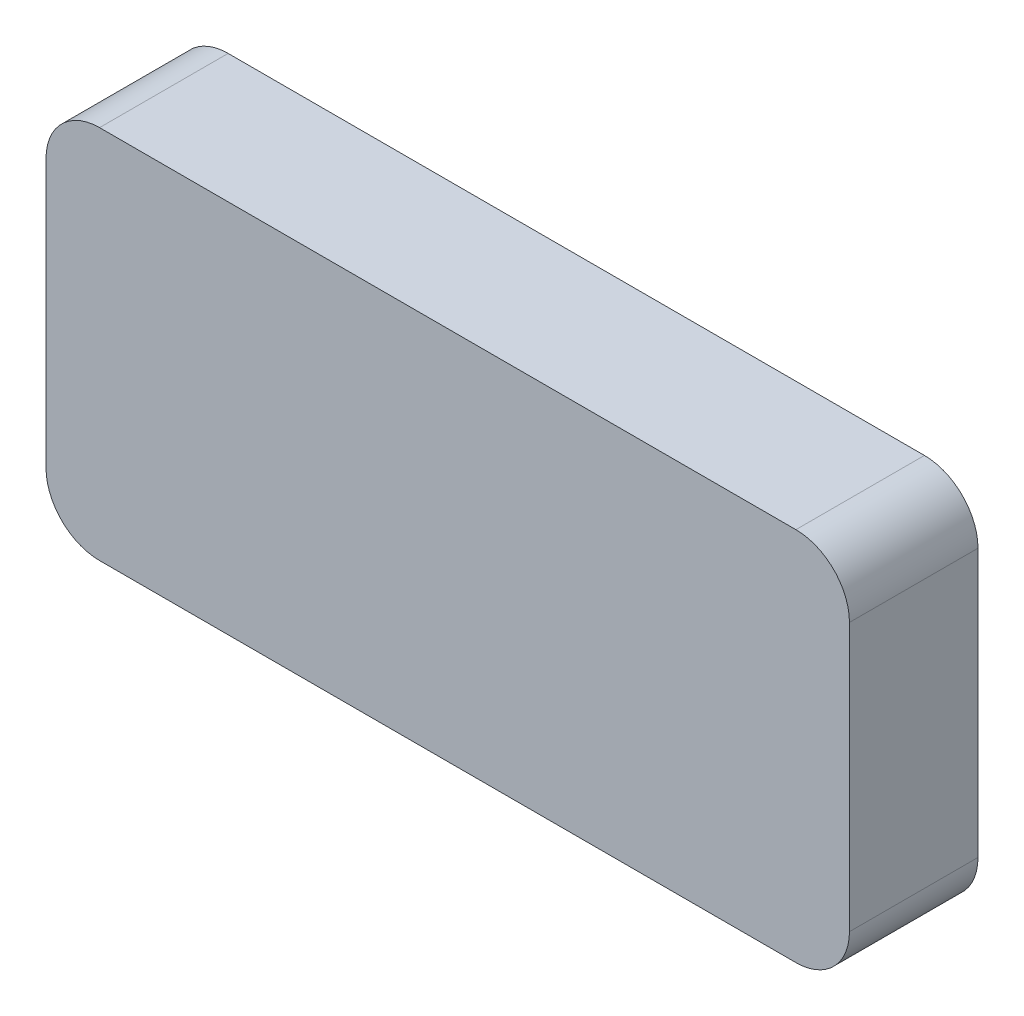
ISO-10303-21;
HEADER;
FILE_DESCRIPTION(('STEP AP214'),'2;1');
FILE_NAME('part.step','',(''),(''),'','','');
FILE_SCHEMA(('AUTOMOTIVE_DESIGN { 1 0 10303 214 1 1 1 1 }'));
ENDSEC;
DATA;
#1=APPLICATION_CONTEXT('core data for automotive mechanical design processes');
#2=APPLICATION_PROTOCOL_DEFINITION('international standard','automotive_design',2000,#1);
#3=PRODUCT_CONTEXT('',#1,'mechanical');
#4=PRODUCT('Part','Part','',(#3));
#5=PRODUCT_RELATED_PRODUCT_CATEGORY('part','',(#4));
#6=PRODUCT_DEFINITION_FORMATION('','',#4);
#7=PRODUCT_DEFINITION_CONTEXT('part definition',#1,'design');
#8=PRODUCT_DEFINITION('design','',#6,#7);
#9=PRODUCT_DEFINITION_SHAPE('','',#8);
#10=(LENGTH_UNIT() NAMED_UNIT(*) SI_UNIT(.MILLI.,.METRE.));
#11=(NAMED_UNIT(*) PLANE_ANGLE_UNIT() SI_UNIT($,.RADIAN.));
#12=(NAMED_UNIT(*) SI_UNIT($,.STERADIAN.) SOLID_ANGLE_UNIT());
#13=UNCERTAINTY_MEASURE_WITH_UNIT(LENGTH_MEASURE(1.E-05),#10,'distance_accuracy_value','');
#14=(GEOMETRIC_REPRESENTATION_CONTEXT(3) GLOBAL_UNCERTAINTY_ASSIGNED_CONTEXT((#13)) GLOBAL_UNIT_ASSIGNED_CONTEXT((#10,
#11,#12)) REPRESENTATION_CONTEXT('',''));
#15=CARTESIAN_POINT('',(0.,0.,0.));
#16=DIRECTION('',(0.,0.,1.));
#17=DIRECTION('',(1.,0.,0.));
#18=AXIS2_PLACEMENT_3D('',#15,#16,#17);
#19=CARTESIAN_POINT('',(0.,0.,12.));
#20=DIRECTION('',(1.,0.,0.));
#21=DIRECTION('',(0.,1.,0.));
#22=AXIS2_PLACEMENT_3D('',#19,#20,#21);
#23=PLANE('',#22);
#24=DIRECTION('',(0.,-1.,0.));
#25=VECTOR('',#24,1.);
#26=CARTESIAN_POINT('',(0.,0.,0.));
#27=LINE('',#26,#25);
#28=CARTESIAN_POINT('',(0.,30.,0.));
#29=VERTEX_POINT('',#28);
#30=CARTESIAN_POINT('',(0.,5.,0.));
#31=VERTEX_POINT('',#30);
#32=EDGE_CURVE('E142',#29,#31,#27,.T.);
#33=ORIENTED_EDGE('',*,*,#32,.T.);
#34=DIRECTION('',(0.,0.,-1.));
#35=VECTOR('',#34,1.);
#36=CARTESIAN_POINT('',(0.,5.,12.));
#37=LINE('',#36,#35);
#38=CARTESIAN_POINT('',(0.,5.,12.));
#39=VERTEX_POINT('',#38);
#40=EDGE_CURVE('E117',#31,#39,#37,.F.);
#41=ORIENTED_EDGE('',*,*,#40,.T.);
#42=DIRECTION('',(0.,-1.,0.));
#43=VECTOR('',#42,1.);
#44=CARTESIAN_POINT('',(0.,0.,12.));
#45=LINE('',#44,#43);
#46=CARTESIAN_POINT('',(0.,30.,12.));
#47=VERTEX_POINT('',#46);
#48=EDGE_CURVE('E154',#47,#39,#45,.T.);
#49=ORIENTED_EDGE('',*,*,#48,.F.);
#50=DIRECTION('',(0.,0.,-1.));
#51=VECTOR('',#50,1.);
#52=CARTESIAN_POINT('',(0.,30.,12.));
#53=LINE('',#52,#51);
#54=EDGE_CURVE('E123',#47,#29,#53,.T.);
#55=ORIENTED_EDGE('',*,*,#54,.T.);
#56=EDGE_LOOP('',(#33,#41,#49,#55));
#57=FACE_BOUND('',#56,.T.);
#58=ADVANCED_FACE('F45',(#57),#23,.F.);
#59=CARTESIAN_POINT('',(0.,0.,12.));
#60=DIRECTION('',(0.,1.,0.));
#61=DIRECTION('',(0.,0.,1.));
#62=AXIS2_PLACEMENT_3D('',#59,#60,#61);
#63=PLANE('',#62);
#64=DIRECTION('',(1.,0.,0.));
#65=VECTOR('',#64,1.);
#66=CARTESIAN_POINT('',(0.,0.,12.));
#67=LINE('',#66,#65);
#68=CARTESIAN_POINT('',(5.,0.,12.));
#69=VERTEX_POINT('',#68);
#70=CARTESIAN_POINT('',(70.,0.,12.));
#71=VERTEX_POINT('',#70);
#72=EDGE_CURVE('E133',#69,#71,#67,.T.);
#73=ORIENTED_EDGE('',*,*,#72,.F.);
#74=DIRECTION('',(0.,0.,-1.));
#75=VECTOR('',#74,1.);
#76=CARTESIAN_POINT('',(5.,0.,12.));
#77=LINE('',#76,#75);
#78=CARTESIAN_POINT('',(5.,0.,0.));
#79=VERTEX_POINT('',#78);
#80=EDGE_CURVE('E116',#69,#79,#77,.T.);
#81=ORIENTED_EDGE('',*,*,#80,.T.);
#82=DIRECTION('',(1.,0.,0.));
#83=VECTOR('',#82,1.);
#84=CARTESIAN_POINT('',(0.,0.,0.));
#85=LINE('',#84,#83);
#86=CARTESIAN_POINT('',(70.,0.,0.));
#87=VERTEX_POINT('',#86);
#88=EDGE_CURVE('E130',#79,#87,#85,.T.);
#89=ORIENTED_EDGE('',*,*,#88,.T.);
#90=DIRECTION('',(0.,0.,-1.));
#91=VECTOR('',#90,1.);
#92=CARTESIAN_POINT('',(70.,0.,12.));
#93=LINE('',#92,#91);
#94=EDGE_CURVE('E136',#87,#71,#93,.F.);
#95=ORIENTED_EDGE('',*,*,#94,.T.);
#96=EDGE_LOOP('',(#73,#81,#89,#95));
#97=FACE_BOUND('',#96,.T.);
#98=ADVANCED_FACE('F129',(#97),#63,.F.);
#99=CARTESIAN_POINT('',(75.,0.,12.));
#100=DIRECTION('',(-1.,0.,0.));
#101=DIRECTION('',(0.,-1.,0.));
#102=AXIS2_PLACEMENT_3D('',#99,#100,#101);
#103=PLANE('',#102);
#104=DIRECTION('',(0.,1.,0.));
#105=VECTOR('',#104,1.);
#106=CARTESIAN_POINT('',(75.,0.,12.));
#107=LINE('',#106,#105);
#108=CARTESIAN_POINT('',(75.,5.,12.));
#109=VERTEX_POINT('',#108);
#110=CARTESIAN_POINT('',(75.,30.,12.));
#111=VERTEX_POINT('',#110);
#112=EDGE_CURVE('E190',#109,#111,#107,.T.);
#113=ORIENTED_EDGE('',*,*,#112,.F.);
#114=DIRECTION('',(0.,0.,-1.));
#115=VECTOR('',#114,1.);
#116=CARTESIAN_POINT('',(75.,5.,12.));
#117=LINE('',#116,#115);
#118=CARTESIAN_POINT('',(75.,5.,0.));
#119=VERTEX_POINT('',#118);
#120=EDGE_CURVE('E184',#109,#119,#117,.T.);
#121=ORIENTED_EDGE('',*,*,#120,.T.);
#122=DIRECTION('',(0.,1.,0.));
#123=VECTOR('',#122,1.);
#124=CARTESIAN_POINT('',(75.,0.,0.));
#125=LINE('',#124,#123);
#126=CARTESIAN_POINT('',(75.,30.,0.));
#127=VERTEX_POINT('',#126);
#128=EDGE_CURVE('E141',#119,#127,#125,.T.);
#129=ORIENTED_EDGE('',*,*,#128,.T.);
#130=DIRECTION('',(0.,0.,-1.));
#131=VECTOR('',#130,1.);
#132=CARTESIAN_POINT('',(75.,30.,12.));
#133=LINE('',#132,#131);
#134=EDGE_CURVE('E181',#127,#111,#133,.F.);
#135=ORIENTED_EDGE('',*,*,#134,.T.);
#136=EDGE_LOOP('',(#113,#121,#129,#135));
#137=FACE_BOUND('',#136,.T.);
#138=ADVANCED_FACE('F211',(#137),#103,.F.);
#139=CARTESIAN_POINT('',(0.,35.,12.));
#140=DIRECTION('',(0.,-1.,0.));
#141=DIRECTION('',(0.,0.,-1.));
#142=AXIS2_PLACEMENT_3D('',#139,#140,#141);
#143=PLANE('',#142);
#144=DIRECTION('',(-1.,0.,0.));
#145=VECTOR('',#144,1.);
#146=CARTESIAN_POINT('',(0.,35.,12.));
#147=LINE('',#146,#145);
#148=CARTESIAN_POINT('',(70.,35.,12.));
#149=VERTEX_POINT('',#148);
#150=CARTESIAN_POINT('',(5.00000000000001,35.,12.));
#151=VERTEX_POINT('',#150);
#152=EDGE_CURVE('E156',#149,#151,#147,.T.);
#153=ORIENTED_EDGE('',*,*,#152,.F.);
#154=DIRECTION('',(0.,0.,-1.));
#155=VECTOR('',#154,1.);
#156=CARTESIAN_POINT('',(70.,35.,12.));
#157=LINE('',#156,#155);
#158=CARTESIAN_POINT('',(70.,35.,0.));
#159=VERTEX_POINT('',#158);
#160=EDGE_CURVE('E11',#149,#159,#157,.T.);
#161=ORIENTED_EDGE('',*,*,#160,.T.);
#162=DIRECTION('',(-1.,0.,0.));
#163=VECTOR('',#162,1.);
#164=CARTESIAN_POINT('',(0.,35.,0.));
#165=LINE('',#164,#163);
#166=CARTESIAN_POINT('',(5.00000000000001,35.,0.));
#167=VERTEX_POINT('',#166);
#168=EDGE_CURVE('E147',#159,#167,#165,.T.);
#169=ORIENTED_EDGE('',*,*,#168,.T.);
#170=DIRECTION('',(0.,0.,-1.));
#171=VECTOR('',#170,1.);
#172=CARTESIAN_POINT('',(5.00000000000001,35.,12.));
#173=LINE('',#172,#171);
#174=EDGE_CURVE('E54',#167,#151,#173,.F.);
#175=ORIENTED_EDGE('',*,*,#174,.T.);
#176=EDGE_LOOP('',(#153,#161,#169,#175));
#177=FACE_BOUND('',#176,.T.);
#178=ADVANCED_FACE('F204',(#177),#143,.F.);
#179=CARTESIAN_POINT('',(0.,0.,12.));
#180=DIRECTION('',(0.,0.,-1.));
#181=DIRECTION('',(-1.,0.,0.));
#182=AXIS2_PLACEMENT_3D('',#179,#180,#181);
#183=PLANE('',#182);
#184=ORIENTED_EDGE('',*,*,#48,.T.);
#185=CARTESIAN_POINT('',(5.,5.,12.));
#186=DIRECTION('',(0.,0.,-1.));
#187=DIRECTION('',(-1.,0.,0.));
#188=AXIS2_PLACEMENT_3D('',#185,#186,#187);
#189=CIRCLE('',#188,5.);
#190=EDGE_CURVE('E178',#39,#69,#189,.F.);
#191=ORIENTED_EDGE('',*,*,#190,.T.);
#192=ORIENTED_EDGE('',*,*,#72,.T.);
#193=CARTESIAN_POINT('',(70.,5.,12.));
#194=DIRECTION('',(0.,0.,-1.));
#195=DIRECTION('',(-1.,0.,0.));
#196=AXIS2_PLACEMENT_3D('',#193,#194,#195);
#197=CIRCLE('',#196,5.);
#198=EDGE_CURVE('E175',#71,#109,#197,.F.);
#199=ORIENTED_EDGE('',*,*,#198,.T.);
#200=ORIENTED_EDGE('',*,*,#112,.T.);
#201=CARTESIAN_POINT('',(70.,30.,12.));
#202=DIRECTION('',(0.,0.,-1.));
#203=DIRECTION('',(-1.,0.,0.));
#204=AXIS2_PLACEMENT_3D('',#201,#202,#203);
#205=CIRCLE('',#204,5.);
#206=EDGE_CURVE('E67',#111,#149,#205,.F.);
#207=ORIENTED_EDGE('',*,*,#206,.T.);
#208=ORIENTED_EDGE('',*,*,#152,.T.);
#209=CARTESIAN_POINT('',(5.00000000000001,30.,12.));
#210=DIRECTION('',(0.,0.,-1.));
#211=DIRECTION('',(-1.,0.,0.));
#212=AXIS2_PLACEMENT_3D('',#209,#210,#211);
#213=CIRCLE('',#212,5.);
#214=EDGE_CURVE('E170',#151,#47,#213,.F.);
#215=ORIENTED_EDGE('',*,*,#214,.T.);
#216=EDGE_LOOP('',(#184,#191,#192,#199,#200,#207,#208,#215));
#217=FACE_BOUND('',#216,.T.);
#218=ADVANCED_FACE('F198',(#217),#183,.F.);
#219=CARTESIAN_POINT('',(0.,0.,0.));
#220=DIRECTION('',(0.,0.,-1.));
#221=DIRECTION('',(-1.,0.,0.));
#222=AXIS2_PLACEMENT_3D('',#219,#220,#221);
#223=PLANE('',#222);
#224=ORIENTED_EDGE('',*,*,#88,.F.);
#225=CARTESIAN_POINT('',(5.,5.,0.));
#226=DIRECTION('',(0.,0.,-1.));
#227=DIRECTION('',(-1.,0.,0.));
#228=AXIS2_PLACEMENT_3D('',#225,#226,#227);
#229=CIRCLE('',#228,5.);
#230=EDGE_CURVE('E112',#79,#31,#229,.T.);
#231=ORIENTED_EDGE('',*,*,#230,.T.);
#232=ORIENTED_EDGE('',*,*,#32,.F.);
#233=CARTESIAN_POINT('',(5.00000000000001,30.,0.));
#234=DIRECTION('',(0.,0.,-1.));
#235=DIRECTION('',(-1.,0.,0.));
#236=AXIS2_PLACEMENT_3D('',#233,#234,#235);
#237=CIRCLE('',#236,5.);
#238=EDGE_CURVE('E135',#29,#167,#237,.T.);
#239=ORIENTED_EDGE('',*,*,#238,.T.);
#240=ORIENTED_EDGE('',*,*,#168,.F.);
#241=CARTESIAN_POINT('',(70.,30.,0.));
#242=DIRECTION('',(0.,0.,-1.));
#243=DIRECTION('',(-1.,0.,0.));
#244=AXIS2_PLACEMENT_3D('',#241,#242,#243);
#245=CIRCLE('',#244,5.);
#246=EDGE_CURVE('E160',#159,#127,#245,.T.);
#247=ORIENTED_EDGE('',*,*,#246,.T.);
#248=ORIENTED_EDGE('',*,*,#128,.F.);
#249=CARTESIAN_POINT('',(70.,5.,0.));
#250=DIRECTION('',(0.,0.,-1.));
#251=DIRECTION('',(-1.,0.,0.));
#252=AXIS2_PLACEMENT_3D('',#249,#250,#251);
#253=CIRCLE('',#252,5.);
#254=EDGE_CURVE('E124',#119,#87,#253,.T.);
#255=ORIENTED_EDGE('',*,*,#254,.T.);
#256=EDGE_LOOP('',(#224,#231,#232,#239,#240,#247,#248,#255));
#257=FACE_BOUND('',#256,.T.);
#258=ADVANCED_FACE('F138',(#257),#223,.T.);
#259=CARTESIAN_POINT('',(5.,5.,12.));
#260=DIRECTION('',(0.,0.,-1.));
#261=DIRECTION('',(-1.,0.,0.));
#262=AXIS2_PLACEMENT_3D('',#259,#260,#261);
#263=CYLINDRICAL_SURFACE('',#262,5.);
#264=ORIENTED_EDGE('',*,*,#190,.F.);
#265=ORIENTED_EDGE('',*,*,#40,.F.);
#266=ORIENTED_EDGE('',*,*,#230,.F.);
#267=ORIENTED_EDGE('',*,*,#80,.F.);
#268=EDGE_LOOP('',(#264,#265,#266,#267));
#269=FACE_BOUND('',#268,.T.);
#270=ADVANCED_FACE('F115',(#269),#263,.T.);
#271=CARTESIAN_POINT('',(70.,5.,12.));
#272=DIRECTION('',(0.,0.,-1.));
#273=DIRECTION('',(-1.,0.,0.));
#274=AXIS2_PLACEMENT_3D('',#271,#272,#273);
#275=CYLINDRICAL_SURFACE('',#274,5.);
#276=ORIENTED_EDGE('',*,*,#198,.F.);
#277=ORIENTED_EDGE('',*,*,#94,.F.);
#278=ORIENTED_EDGE('',*,*,#254,.F.);
#279=ORIENTED_EDGE('',*,*,#120,.F.);
#280=EDGE_LOOP('',(#276,#277,#278,#279));
#281=FACE_BOUND('',#280,.T.);
#282=ADVANCED_FACE('F215',(#281),#275,.T.);
#283=CARTESIAN_POINT('',(70.,30.,12.));
#284=DIRECTION('',(0.,0.,-1.));
#285=DIRECTION('',(-1.,0.,0.));
#286=AXIS2_PLACEMENT_3D('',#283,#284,#285);
#287=CYLINDRICAL_SURFACE('',#286,5.);
#288=ORIENTED_EDGE('',*,*,#206,.F.);
#289=ORIENTED_EDGE('',*,*,#134,.F.);
#290=ORIENTED_EDGE('',*,*,#246,.F.);
#291=ORIENTED_EDGE('',*,*,#160,.F.);
#292=EDGE_LOOP('',(#288,#289,#290,#291));
#293=FACE_BOUND('',#292,.T.);
#294=ADVANCED_FACE('F207',(#293),#287,.T.);
#295=CARTESIAN_POINT('',(5.00000000000001,30.,12.));
#296=DIRECTION('',(0.,0.,-1.));
#297=DIRECTION('',(-1.,0.,0.));
#298=AXIS2_PLACEMENT_3D('',#295,#296,#297);
#299=CYLINDRICAL_SURFACE('',#298,5.);
#300=ORIENTED_EDGE('',*,*,#214,.F.);
#301=ORIENTED_EDGE('',*,*,#174,.F.);
#302=ORIENTED_EDGE('',*,*,#238,.F.);
#303=ORIENTED_EDGE('',*,*,#54,.F.);
#304=EDGE_LOOP('',(#300,#301,#302,#303));
#305=FACE_BOUND('',#304,.T.);
#306=ADVANCED_FACE('F47',(#305),#299,.T.);
#307=CLOSED_SHELL('',(#58,#98,#138,#178,#218,#258,#270,#282,#294,#306));
#308=MANIFOLD_SOLID_BREP('B2',#307);
#309=ADVANCED_BREP_SHAPE_REPRESENTATION('',(#18,#308),#14);
#310=SHAPE_DEFINITION_REPRESENTATION(#9,#309);
ENDSEC;
END-ISO-10303-21;
